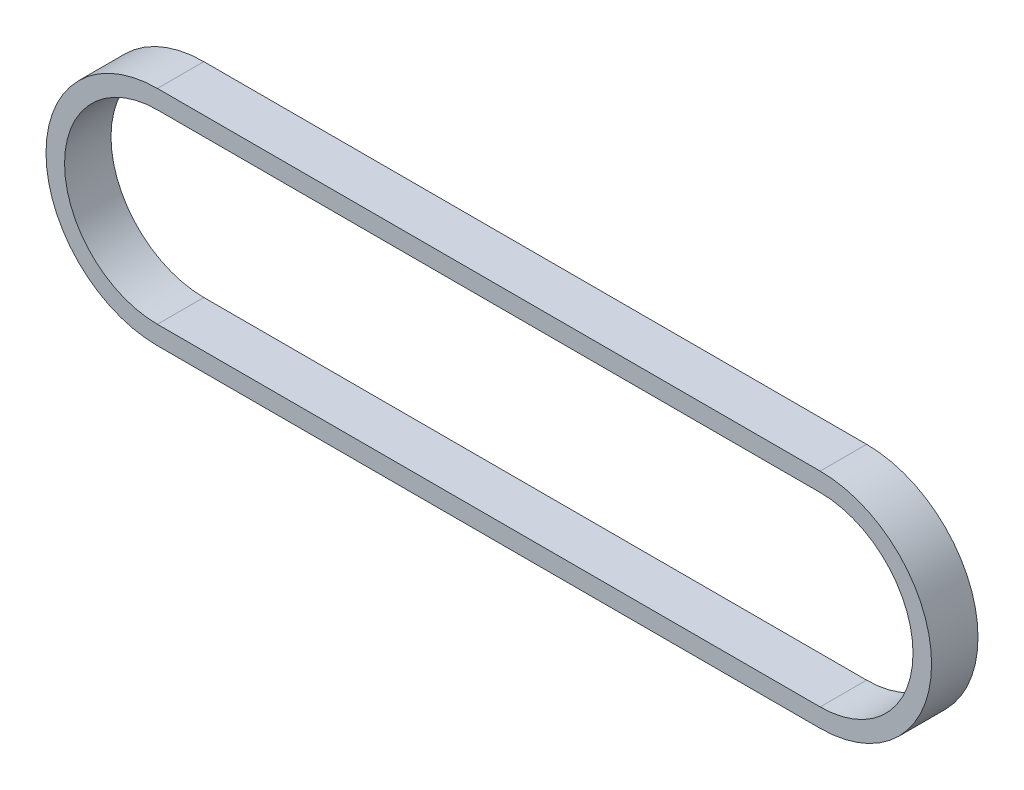
ISO-10303-21;
HEADER;
FILE_DESCRIPTION(('STEP AP214'),'2;1');
FILE_NAME('part.step','',(''),(''),'','','');
FILE_SCHEMA(('AUTOMOTIVE_DESIGN { 1 0 10303 214 1 1 1 1 }'));
ENDSEC;
DATA;
#1=APPLICATION_CONTEXT('core data for automotive mechanical design processes');
#2=APPLICATION_PROTOCOL_DEFINITION('international standard','automotive_design',2000,#1);
#3=PRODUCT_CONTEXT('',#1,'mechanical');
#4=PRODUCT('Part','Part','',(#3));
#5=PRODUCT_RELATED_PRODUCT_CATEGORY('part','',(#4));
#6=PRODUCT_DEFINITION_FORMATION('','',#4);
#7=PRODUCT_DEFINITION_CONTEXT('part definition',#1,'design');
#8=PRODUCT_DEFINITION('design','',#6,#7);
#9=PRODUCT_DEFINITION_SHAPE('','',#8);
#10=(LENGTH_UNIT() NAMED_UNIT(*) SI_UNIT(.MILLI.,.METRE.));
#11=(NAMED_UNIT(*) PLANE_ANGLE_UNIT() SI_UNIT($,.RADIAN.));
#12=(NAMED_UNIT(*) SI_UNIT($,.STERADIAN.) SOLID_ANGLE_UNIT());
#13=UNCERTAINTY_MEASURE_WITH_UNIT(LENGTH_MEASURE(1.E-05),#10,'distance_accuracy_value','');
#14=(GEOMETRIC_REPRESENTATION_CONTEXT(3) GLOBAL_UNCERTAINTY_ASSIGNED_CONTEXT((#13)) GLOBAL_UNIT_ASSIGNED_CONTEXT((#10,
#11,#12)) REPRESENTATION_CONTEXT('',''));
#15=CARTESIAN_POINT('',(0.,0.,0.));
#16=DIRECTION('',(0.,0.,1.));
#17=DIRECTION('',(1.,0.,0.));
#18=AXIS2_PLACEMENT_3D('',#15,#16,#17);
#19=CARTESIAN_POINT('',(0.,0.,6.35));
#20=DIRECTION('',(0.,0.,1.));
#21=DIRECTION('',(1.,0.,0.));
#22=AXIS2_PLACEMENT_3D('',#19,#20,#21);
#23=PLANE('',#22);
#24=CARTESIAN_POINT('',(0.,0.,6.35));
#25=DIRECTION('',(0.,0.,1.));
#26=DIRECTION('',(1.,0.,0.));
#27=AXIS2_PLACEMENT_3D('',#24,#25,#26);
#28=CIRCLE('',#27,15.24);
#29=CARTESIAN_POINT('',(0.,15.24,6.35));
#30=VERTEX_POINT('',#29);
#31=CARTESIAN_POINT('',(0.,-15.24,6.35));
#32=VERTEX_POINT('',#31);
#33=EDGE_CURVE('E157',#30,#32,#28,.T.);
#34=ORIENTED_EDGE('',*,*,#33,.T.);
#35=DIRECTION('',(1.,0.,0.));
#36=VECTOR('',#35,1.);
#37=CARTESIAN_POINT('',(0.,-15.24,6.35));
#38=LINE('',#37,#36);
#39=CARTESIAN_POINT('',(90.66149,-15.24,6.35));
#40=VERTEX_POINT('',#39);
#41=EDGE_CURVE('E161',#32,#40,#38,.T.);
#42=ORIENTED_EDGE('',*,*,#41,.T.);
#43=CARTESIAN_POINT('',(90.66149,0.,6.35));
#44=DIRECTION('',(0.,0.,1.));
#45=DIRECTION('',(1.,0.,0.));
#46=AXIS2_PLACEMENT_3D('',#43,#44,#45);
#47=CIRCLE('',#46,15.24);
#48=CARTESIAN_POINT('',(90.66149,15.24,6.35));
#49=VERTEX_POINT('',#48);
#50=EDGE_CURVE('E165',#40,#49,#47,.T.);
#51=ORIENTED_EDGE('',*,*,#50,.T.);
#52=DIRECTION('',(-1.,0.,0.));
#53=VECTOR('',#52,1.);
#54=CARTESIAN_POINT('',(0.,15.24,6.35));
#55=LINE('',#54,#53);
#56=EDGE_CURVE('E168',#49,#30,#55,.T.);
#57=ORIENTED_EDGE('',*,*,#56,.T.);
#58=EDGE_LOOP('',(#34,#42,#51,#57));
#59=FACE_BOUND('',#58,.T.);
#60=DIRECTION('',(1.,0.,0.));
#61=VECTOR('',#60,1.);
#62=CARTESIAN_POINT('',(0.,-12.7,6.35));
#63=LINE('',#62,#61);
#64=CARTESIAN_POINT('',(0.,-12.7,6.35));
#65=VERTEX_POINT('',#64);
#66=CARTESIAN_POINT('',(90.66149,-12.7,6.35));
#67=VERTEX_POINT('',#66);
#68=EDGE_CURVE('E118',#65,#67,#63,.T.);
#69=ORIENTED_EDGE('',*,*,#68,.F.);
#70=CARTESIAN_POINT('',(0.,0.,6.35));
#71=DIRECTION('',(0.,0.,1.));
#72=DIRECTION('',(1.,0.,0.));
#73=AXIS2_PLACEMENT_3D('',#70,#71,#72);
#74=CIRCLE('',#73,12.7);
#75=CARTESIAN_POINT('',(0.,12.7,6.35));
#76=VERTEX_POINT('',#75);
#77=EDGE_CURVE('E109',#76,#65,#74,.T.);
#78=ORIENTED_EDGE('',*,*,#77,.F.);
#79=DIRECTION('',(-1.,0.,0.));
#80=VECTOR('',#79,1.);
#81=CARTESIAN_POINT('',(0.,12.7,6.35));
#82=LINE('',#81,#80);
#83=CARTESIAN_POINT('',(90.66149,12.7,6.35));
#84=VERTEX_POINT('',#83);
#85=EDGE_CURVE('E135',#84,#76,#82,.T.);
#86=ORIENTED_EDGE('',*,*,#85,.F.);
#87=CARTESIAN_POINT('',(90.66149,0.,6.35));
#88=DIRECTION('',(0.,0.,1.));
#89=DIRECTION('',(1.,0.,0.));
#90=AXIS2_PLACEMENT_3D('',#87,#88,#89);
#91=CIRCLE('',#90,12.7);
#92=EDGE_CURVE('E131',#67,#84,#91,.T.);
#93=ORIENTED_EDGE('',*,*,#92,.F.);
#94=EDGE_LOOP('',(#69,#78,#86,#93));
#95=FACE_BOUND('',#94,.T.);
#96=ADVANCED_FACE('F43',(#59,#95),#23,.T.);
#97=CARTESIAN_POINT('',(0.,0.,0.));
#98=DIRECTION('',(0.,0.,1.));
#99=DIRECTION('',(1.,0.,0.));
#100=AXIS2_PLACEMENT_3D('',#97,#98,#99);
#101=PLANE('',#100);
#102=CARTESIAN_POINT('',(0.,0.,0.));
#103=DIRECTION('',(0.,0.,1.));
#104=DIRECTION('',(1.,0.,0.));
#105=AXIS2_PLACEMENT_3D('',#102,#103,#104);
#106=CIRCLE('',#105,15.24);
#107=CARTESIAN_POINT('',(0.,15.24,0.));
#108=VERTEX_POINT('',#107);
#109=CARTESIAN_POINT('',(0.,-15.24,0.));
#110=VERTEX_POINT('',#109);
#111=EDGE_CURVE('E127',#108,#110,#106,.T.);
#112=ORIENTED_EDGE('',*,*,#111,.F.);
#113=DIRECTION('',(-1.,0.,0.));
#114=VECTOR('',#113,1.);
#115=CARTESIAN_POINT('',(0.,15.24,0.));
#116=LINE('',#115,#114);
#117=CARTESIAN_POINT('',(90.66149,15.24,0.));
#118=VERTEX_POINT('',#117);
#119=EDGE_CURVE('E162',#118,#108,#116,.T.);
#120=ORIENTED_EDGE('',*,*,#119,.F.);
#121=CARTESIAN_POINT('',(90.66149,0.,0.));
#122=DIRECTION('',(0.,0.,1.));
#123=DIRECTION('',(1.,0.,0.));
#124=AXIS2_PLACEMENT_3D('',#121,#122,#123);
#125=CIRCLE('',#124,15.24);
#126=CARTESIAN_POINT('',(90.66149,-15.24,0.));
#127=VERTEX_POINT('',#126);
#128=EDGE_CURVE('E178',#127,#118,#125,.T.);
#129=ORIENTED_EDGE('',*,*,#128,.F.);
#130=DIRECTION('',(1.,0.,0.));
#131=VECTOR('',#130,1.);
#132=CARTESIAN_POINT('',(0.,-15.24,0.));
#133=LINE('',#132,#131);
#134=EDGE_CURVE('E175',#110,#127,#133,.T.);
#135=ORIENTED_EDGE('',*,*,#134,.F.);
#136=EDGE_LOOP('',(#112,#120,#129,#135));
#137=FACE_BOUND('',#136,.T.);
#138=CARTESIAN_POINT('',(0.,0.,0.));
#139=DIRECTION('',(0.,0.,1.));
#140=DIRECTION('',(1.,0.,0.));
#141=AXIS2_PLACEMENT_3D('',#138,#139,#140);
#142=CIRCLE('',#141,12.7);
#143=CARTESIAN_POINT('',(0.,12.7,0.));
#144=VERTEX_POINT('',#143);
#145=CARTESIAN_POINT('',(0.,-12.7,0.));
#146=VERTEX_POINT('',#145);
#147=EDGE_CURVE('E67',#144,#146,#142,.T.);
#148=ORIENTED_EDGE('',*,*,#147,.T.);
#149=DIRECTION('',(1.,0.,0.));
#150=VECTOR('',#149,1.);
#151=CARTESIAN_POINT('',(0.,-12.7,0.));
#152=LINE('',#151,#150);
#153=CARTESIAN_POINT('',(90.66149,-12.7,0.));
#154=VERTEX_POINT('',#153);
#155=EDGE_CURVE('E125',#146,#154,#152,.T.);
#156=ORIENTED_EDGE('',*,*,#155,.T.);
#157=CARTESIAN_POINT('',(90.66149,0.,0.));
#158=DIRECTION('',(0.,0.,1.));
#159=DIRECTION('',(1.,0.,0.));
#160=AXIS2_PLACEMENT_3D('',#157,#158,#159);
#161=CIRCLE('',#160,12.7);
#162=CARTESIAN_POINT('',(90.66149,12.7,0.));
#163=VERTEX_POINT('',#162);
#164=EDGE_CURVE('E144',#154,#163,#161,.T.);
#165=ORIENTED_EDGE('',*,*,#164,.T.);
#166=DIRECTION('',(-1.,0.,0.));
#167=VECTOR('',#166,1.);
#168=CARTESIAN_POINT('',(0.,12.7,0.));
#169=LINE('',#168,#167);
#170=EDGE_CURVE('E119',#163,#144,#169,.T.);
#171=ORIENTED_EDGE('',*,*,#170,.T.);
#172=EDGE_LOOP('',(#148,#156,#165,#171));
#173=FACE_BOUND('',#172,.T.);
#174=ADVANCED_FACE('F201',(#137,#173),#101,.F.);
#175=CARTESIAN_POINT('',(0.,0.,6.35));
#176=DIRECTION('',(0.,0.,-1.));
#177=DIRECTION('',(-1.,0.,0.));
#178=AXIS2_PLACEMENT_3D('',#175,#176,#177);
#179=CYLINDRICAL_SURFACE('',#178,15.24);
#180=ORIENTED_EDGE('',*,*,#111,.T.);
#181=DIRECTION('',(0.,0.,-1.));
#182=VECTOR('',#181,1.);
#183=CARTESIAN_POINT('',(0.,-15.24,6.35));
#184=LINE('',#183,#182);
#185=EDGE_CURVE('E11',#32,#110,#184,.T.);
#186=ORIENTED_EDGE('',*,*,#185,.F.);
#187=ORIENTED_EDGE('',*,*,#33,.F.);
#188=DIRECTION('',(0.,0.,-1.));
#189=VECTOR('',#188,1.);
#190=CARTESIAN_POINT('',(0.,15.24,6.35));
#191=LINE('',#190,#189);
#192=EDGE_CURVE('E171',#30,#108,#191,.T.);
#193=ORIENTED_EDGE('',*,*,#192,.T.);
#194=EDGE_LOOP('',(#180,#186,#187,#193));
#195=FACE_BOUND('',#194,.T.);
#196=ADVANCED_FACE('F45',(#195),#179,.T.);
#197=CARTESIAN_POINT('',(0.,-15.24,6.35));
#198=DIRECTION('',(0.,1.,0.));
#199=DIRECTION('',(0.,0.,1.));
#200=AXIS2_PLACEMENT_3D('',#197,#198,#199);
#201=PLANE('',#200);
#202=ORIENTED_EDGE('',*,*,#134,.T.);
#203=DIRECTION('',(0.,0.,-1.));
#204=VECTOR('',#203,1.);
#205=CARTESIAN_POINT('',(90.66149,-15.24,6.35));
#206=LINE('',#205,#204);
#207=EDGE_CURVE('E52',#40,#127,#206,.T.);
#208=ORIENTED_EDGE('',*,*,#207,.F.);
#209=ORIENTED_EDGE('',*,*,#41,.F.);
#210=ORIENTED_EDGE('',*,*,#185,.T.);
#211=EDGE_LOOP('',(#202,#208,#209,#210));
#212=FACE_BOUND('',#211,.T.);
#213=ADVANCED_FACE('F211',(#212),#201,.F.);
#214=CARTESIAN_POINT('',(90.66149,0.,6.35));
#215=DIRECTION('',(0.,0.,-1.));
#216=DIRECTION('',(-1.,0.,0.));
#217=AXIS2_PLACEMENT_3D('',#214,#215,#216);
#218=CYLINDRICAL_SURFACE('',#217,15.24);
#219=ORIENTED_EDGE('',*,*,#128,.T.);
#220=DIRECTION('',(0.,0.,-1.));
#221=VECTOR('',#220,1.);
#222=CARTESIAN_POINT('',(90.66149,15.24,6.35));
#223=LINE('',#222,#221);
#224=EDGE_CURVE('E186',#49,#118,#223,.T.);
#225=ORIENTED_EDGE('',*,*,#224,.F.);
#226=ORIENTED_EDGE('',*,*,#50,.F.);
#227=ORIENTED_EDGE('',*,*,#207,.T.);
#228=EDGE_LOOP('',(#219,#225,#226,#227));
#229=FACE_BOUND('',#228,.T.);
#230=ADVANCED_FACE('F195',(#229),#218,.T.);
#231=CARTESIAN_POINT('',(0.,15.24,6.35));
#232=DIRECTION('',(0.,-1.,0.));
#233=DIRECTION('',(0.,0.,-1.));
#234=AXIS2_PLACEMENT_3D('',#231,#232,#233);
#235=PLANE('',#234);
#236=ORIENTED_EDGE('',*,*,#119,.T.);
#237=ORIENTED_EDGE('',*,*,#192,.F.);
#238=ORIENTED_EDGE('',*,*,#56,.F.);
#239=ORIENTED_EDGE('',*,*,#224,.T.);
#240=EDGE_LOOP('',(#236,#237,#238,#239));
#241=FACE_BOUND('',#240,.T.);
#242=ADVANCED_FACE('F205',(#241),#235,.F.);
#243=CARTESIAN_POINT('',(0.,0.,6.35));
#244=DIRECTION('',(0.,0.,-1.));
#245=DIRECTION('',(-1.,0.,0.));
#246=AXIS2_PLACEMENT_3D('',#243,#244,#245);
#247=CYLINDRICAL_SURFACE('',#246,12.7);
#248=ORIENTED_EDGE('',*,*,#147,.F.);
#249=DIRECTION('',(0.,0.,-1.));
#250=VECTOR('',#249,1.);
#251=CARTESIAN_POINT('',(0.,12.7,6.35));
#252=LINE('',#251,#250);
#253=EDGE_CURVE('E113',#76,#144,#252,.T.);
#254=ORIENTED_EDGE('',*,*,#253,.F.);
#255=ORIENTED_EDGE('',*,*,#77,.T.);
#256=DIRECTION('',(0.,0.,-1.));
#257=VECTOR('',#256,1.);
#258=CARTESIAN_POINT('',(0.,-12.7,6.35));
#259=LINE('',#258,#257);
#260=EDGE_CURVE('E112',#65,#146,#259,.T.);
#261=ORIENTED_EDGE('',*,*,#260,.T.);
#262=EDGE_LOOP('',(#248,#254,#255,#261));
#263=FACE_BOUND('',#262,.T.);
#264=ADVANCED_FACE('F111',(#263),#247,.F.);
#265=CARTESIAN_POINT('',(0.,-12.7,6.35));
#266=DIRECTION('',(0.,1.,0.));
#267=DIRECTION('',(0.,0.,1.));
#268=AXIS2_PLACEMENT_3D('',#265,#266,#267);
#269=PLANE('',#268);
#270=ORIENTED_EDGE('',*,*,#155,.F.);
#271=ORIENTED_EDGE('',*,*,#260,.F.);
#272=ORIENTED_EDGE('',*,*,#68,.T.);
#273=DIRECTION('',(0.,0.,-1.));
#274=VECTOR('',#273,1.);
#275=CARTESIAN_POINT('',(90.66149,-12.7,6.35));
#276=LINE('',#275,#274);
#277=EDGE_CURVE('E128',#67,#154,#276,.T.);
#278=ORIENTED_EDGE('',*,*,#277,.T.);
#279=EDGE_LOOP('',(#270,#271,#272,#278));
#280=FACE_BOUND('',#279,.T.);
#281=ADVANCED_FACE('F122',(#280),#269,.T.);
#282=CARTESIAN_POINT('',(90.66149,0.,6.35));
#283=DIRECTION('',(0.,0.,-1.));
#284=DIRECTION('',(-1.,0.,0.));
#285=AXIS2_PLACEMENT_3D('',#282,#283,#284);
#286=CYLINDRICAL_SURFACE('',#285,12.7);
#287=ORIENTED_EDGE('',*,*,#164,.F.);
#288=ORIENTED_EDGE('',*,*,#277,.F.);
#289=ORIENTED_EDGE('',*,*,#92,.T.);
#290=DIRECTION('',(0.,0.,-1.));
#291=VECTOR('',#290,1.);
#292=CARTESIAN_POINT('',(90.66149,12.7,6.35));
#293=LINE('',#292,#291);
#294=EDGE_CURVE('E59',#84,#163,#293,.T.);
#295=ORIENTED_EDGE('',*,*,#294,.T.);
#296=EDGE_LOOP('',(#287,#288,#289,#295));
#297=FACE_BOUND('',#296,.T.);
#298=ADVANCED_FACE('F234',(#297),#286,.F.);
#299=CARTESIAN_POINT('',(0.,12.7,6.35));
#300=DIRECTION('',(0.,-1.,0.));
#301=DIRECTION('',(0.,0.,-1.));
#302=AXIS2_PLACEMENT_3D('',#299,#300,#301);
#303=PLANE('',#302);
#304=ORIENTED_EDGE('',*,*,#170,.F.);
#305=ORIENTED_EDGE('',*,*,#294,.F.);
#306=ORIENTED_EDGE('',*,*,#85,.T.);
#307=ORIENTED_EDGE('',*,*,#253,.T.);
#308=EDGE_LOOP('',(#304,#305,#306,#307));
#309=FACE_BOUND('',#308,.T.);
#310=ADVANCED_FACE('F238',(#309),#303,.T.);
#311=CLOSED_SHELL('',(#96,#174,#196,#213,#230,#242,#264,#281,#298,#310));
#312=MANIFOLD_SOLID_BREP('B2',#311);
#313=ADVANCED_BREP_SHAPE_REPRESENTATION('',(#18,#312),#14);
#314=SHAPE_DEFINITION_REPRESENTATION(#9,#313);
ENDSEC;
END-ISO-10303-21;
